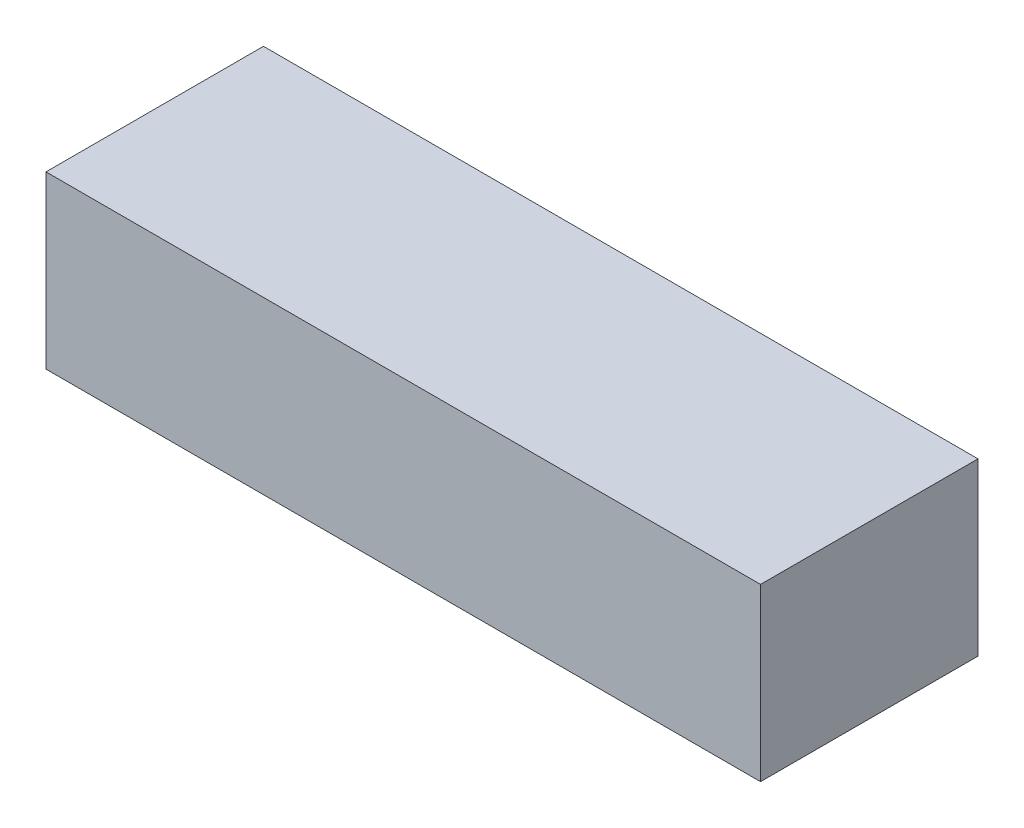
ISO-10303-21;
HEADER;
FILE_DESCRIPTION(('STEP AP214'),'2;1');
FILE_NAME('part.step','',(''),(''),'','','');
FILE_SCHEMA(('AUTOMOTIVE_DESIGN { 1 0 10303 214 1 1 1 1 }'));
ENDSEC;
DATA;
#1=APPLICATION_CONTEXT('core data for automotive mechanical design processes');
#2=APPLICATION_PROTOCOL_DEFINITION('international standard','automotive_design',2000,#1);
#3=PRODUCT_CONTEXT('',#1,'mechanical');
#4=PRODUCT('Part','Part','',(#3));
#5=PRODUCT_RELATED_PRODUCT_CATEGORY('part','',(#4));
#6=PRODUCT_DEFINITION_FORMATION('','',#4);
#7=PRODUCT_DEFINITION_CONTEXT('part definition',#1,'design');
#8=PRODUCT_DEFINITION('design','',#6,#7);
#9=PRODUCT_DEFINITION_SHAPE('','',#8);
#10=(LENGTH_UNIT() NAMED_UNIT(*) SI_UNIT(.MILLI.,.METRE.));
#11=(NAMED_UNIT(*) PLANE_ANGLE_UNIT() SI_UNIT($,.RADIAN.));
#12=(NAMED_UNIT(*) SI_UNIT($,.STERADIAN.) SOLID_ANGLE_UNIT());
#13=UNCERTAINTY_MEASURE_WITH_UNIT(LENGTH_MEASURE(1.E-05),#10,'distance_accuracy_value','');
#14=(GEOMETRIC_REPRESENTATION_CONTEXT(3) GLOBAL_UNCERTAINTY_ASSIGNED_CONTEXT((#13)) GLOBAL_UNIT_ASSIGNED_CONTEXT((#10,
#11,#12)) REPRESENTATION_CONTEXT('',''));
#15=CARTESIAN_POINT('',(0.,0.,0.));
#16=DIRECTION('',(0.,0.,1.));
#17=DIRECTION('',(1.,0.,0.));
#18=AXIS2_PLACEMENT_3D('',#15,#16,#17);
#19=CARTESIAN_POINT('',(92.,11.,14.));
#20=DIRECTION('',(0.,0.,-1.));
#21=DIRECTION('',(0.,1.,0.));
#22=AXIS2_PLACEMENT_3D('',#19,#20,#21);
#23=PLANE('',#22);
#24=DIRECTION('',(0.,-1.,0.));
#25=VECTOR('',#24,1.);
#26=CARTESIAN_POINT('',(0.,11.,14.));
#27=LINE('',#26,#25);
#28=CARTESIAN_POINT('',(0.,11.,14.));
#29=VERTEX_POINT('',#28);
#30=CARTESIAN_POINT('',(0.,-11.,14.));
#31=VERTEX_POINT('',#30);
#32=EDGE_CURVE('E95',#29,#31,#27,.T.);
#33=ORIENTED_EDGE('',*,*,#32,.T.);
#34=DIRECTION('',(-1.,0.,0.));
#35=VECTOR('',#34,1.);
#36=CARTESIAN_POINT('',(92.,-11.,14.));
#37=LINE('',#36,#35);
#38=CARTESIAN_POINT('',(92.,-11.,14.));
#39=VERTEX_POINT('',#38);
#40=EDGE_CURVE('E11',#39,#31,#37,.T.);
#41=ORIENTED_EDGE('',*,*,#40,.F.);
#42=DIRECTION('',(0.,-1.,0.));
#43=VECTOR('',#42,1.);
#44=CARTESIAN_POINT('',(92.,11.,14.));
#45=LINE('',#44,#43);
#46=CARTESIAN_POINT('',(92.,11.,14.));
#47=VERTEX_POINT('',#46);
#48=EDGE_CURVE('E83',#47,#39,#45,.T.);
#49=ORIENTED_EDGE('',*,*,#48,.F.);
#50=DIRECTION('',(-1.,0.,0.));
#51=VECTOR('',#50,1.);
#52=CARTESIAN_POINT('',(92.,11.,14.));
#53=LINE('',#52,#51);
#54=EDGE_CURVE('E91',#47,#29,#53,.T.);
#55=ORIENTED_EDGE('',*,*,#54,.T.);
#56=EDGE_LOOP('',(#33,#41,#49,#55));
#57=FACE_BOUND('',#56,.T.);
#58=ADVANCED_FACE('F32',(#57),#23,.F.);
#59=CARTESIAN_POINT('',(92.,-11.,14.));
#60=DIRECTION('',(0.,1.,0.));
#61=DIRECTION('',(0.,0.,1.));
#62=AXIS2_PLACEMENT_3D('',#59,#60,#61);
#63=PLANE('',#62);
#64=DIRECTION('',(0.,0.,-1.));
#65=VECTOR('',#64,1.);
#66=CARTESIAN_POINT('',(0.,-11.,14.));
#67=LINE('',#66,#65);
#68=CARTESIAN_POINT('',(0.,-11.,-14.));
#69=VERTEX_POINT('',#68);
#70=EDGE_CURVE('E87',#31,#69,#67,.T.);
#71=ORIENTED_EDGE('',*,*,#70,.T.);
#72=DIRECTION('',(-1.,0.,0.));
#73=VECTOR('',#72,1.);
#74=CARTESIAN_POINT('',(92.,-11.,-14.));
#75=LINE('',#74,#73);
#76=CARTESIAN_POINT('',(92.,-11.,-14.));
#77=VERTEX_POINT('',#76);
#78=EDGE_CURVE('E40',#77,#69,#75,.T.);
#79=ORIENTED_EDGE('',*,*,#78,.F.);
#80=DIRECTION('',(0.,0.,-1.));
#81=VECTOR('',#80,1.);
#82=CARTESIAN_POINT('',(92.,-11.,14.));
#83=LINE('',#82,#81);
#84=EDGE_CURVE('E78',#39,#77,#83,.T.);
#85=ORIENTED_EDGE('',*,*,#84,.F.);
#86=ORIENTED_EDGE('',*,*,#40,.T.);
#87=EDGE_LOOP('',(#71,#79,#85,#86));
#88=FACE_BOUND('',#87,.T.);
#89=ADVANCED_FACE('F86',(#88),#63,.F.);
#90=CARTESIAN_POINT('',(92.,11.,-14.));
#91=DIRECTION('',(0.,0.,1.));
#92=DIRECTION('',(0.,-1.,0.));
#93=AXIS2_PLACEMENT_3D('',#90,#91,#92);
#94=PLANE('',#93);
#95=DIRECTION('',(0.,1.,0.));
#96=VECTOR('',#95,1.);
#97=CARTESIAN_POINT('',(0.,11.,-14.));
#98=LINE('',#97,#96);
#99=CARTESIAN_POINT('',(0.,11.,-14.));
#100=VERTEX_POINT('',#99);
#101=EDGE_CURVE('E65',#69,#100,#98,.T.);
#102=ORIENTED_EDGE('',*,*,#101,.T.);
#103=DIRECTION('',(-1.,0.,0.));
#104=VECTOR('',#103,1.);
#105=CARTESIAN_POINT('',(92.,11.,-14.));
#106=LINE('',#105,#104);
#107=CARTESIAN_POINT('',(92.,11.,-14.));
#108=VERTEX_POINT('',#107);
#109=EDGE_CURVE('E88',#108,#100,#106,.T.);
#110=ORIENTED_EDGE('',*,*,#109,.F.);
#111=DIRECTION('',(0.,1.,0.));
#112=VECTOR('',#111,1.);
#113=CARTESIAN_POINT('',(92.,11.,-14.));
#114=LINE('',#113,#112);
#115=EDGE_CURVE('E81',#77,#108,#114,.T.);
#116=ORIENTED_EDGE('',*,*,#115,.F.);
#117=ORIENTED_EDGE('',*,*,#78,.T.);
#118=EDGE_LOOP('',(#102,#110,#116,#117));
#119=FACE_BOUND('',#118,.T.);
#120=ADVANCED_FACE('F89',(#119),#94,.F.);
#121=CARTESIAN_POINT('',(92.,11.,14.));
#122=DIRECTION('',(0.,-1.,0.));
#123=DIRECTION('',(0.,0.,-1.));
#124=AXIS2_PLACEMENT_3D('',#121,#122,#123);
#125=PLANE('',#124);
#126=DIRECTION('',(0.,0.,1.));
#127=VECTOR('',#126,1.);
#128=CARTESIAN_POINT('',(0.,11.,14.));
#129=LINE('',#128,#127);
#130=EDGE_CURVE('E71',#100,#29,#129,.T.);
#131=ORIENTED_EDGE('',*,*,#130,.T.);
#132=ORIENTED_EDGE('',*,*,#54,.F.);
#133=DIRECTION('',(0.,0.,1.));
#134=VECTOR('',#133,1.);
#135=CARTESIAN_POINT('',(92.,11.,14.));
#136=LINE('',#135,#134);
#137=EDGE_CURVE('E48',#108,#47,#136,.T.);
#138=ORIENTED_EDGE('',*,*,#137,.F.);
#139=ORIENTED_EDGE('',*,*,#109,.T.);
#140=EDGE_LOOP('',(#131,#132,#138,#139));
#141=FACE_BOUND('',#140,.T.);
#142=ADVANCED_FACE('F102',(#141),#125,.F.);
#143=CARTESIAN_POINT('',(92.,0.,0.));
#144=DIRECTION('',(1.,0.,0.));
#145=DIRECTION('',(0.,0.,-1.));
#146=AXIS2_PLACEMENT_3D('',#143,#144,#145);
#147=PLANE('',#146);
#148=ORIENTED_EDGE('',*,*,#48,.T.);
#149=ORIENTED_EDGE('',*,*,#84,.T.);
#150=ORIENTED_EDGE('',*,*,#115,.T.);
#151=ORIENTED_EDGE('',*,*,#137,.T.);
#152=EDGE_LOOP('',(#148,#149,#150,#151));
#153=FACE_BOUND('',#152,.T.);
#154=ADVANCED_FACE('F79',(#153),#147,.T.);
#155=CARTESIAN_POINT('',(0.,0.,0.));
#156=DIRECTION('',(1.,0.,0.));
#157=DIRECTION('',(0.,0.,-1.));
#158=AXIS2_PLACEMENT_3D('',#155,#156,#157);
#159=PLANE('',#158);
#160=ORIENTED_EDGE('',*,*,#32,.F.);
#161=ORIENTED_EDGE('',*,*,#130,.F.);
#162=ORIENTED_EDGE('',*,*,#101,.F.);
#163=ORIENTED_EDGE('',*,*,#70,.F.);
#164=EDGE_LOOP('',(#160,#161,#162,#163));
#165=FACE_BOUND('',#164,.T.);
#166=ADVANCED_FACE('F105',(#165),#159,.F.);
#167=CLOSED_SHELL('',(#58,#89,#120,#142,#154,#166));
#168=MANIFOLD_SOLID_BREP('B2',#167);
#169=ADVANCED_BREP_SHAPE_REPRESENTATION('',(#18,#168),#14);
#170=SHAPE_DEFINITION_REPRESENTATION(#9,#169);
ENDSEC;
END-ISO-10303-21;
